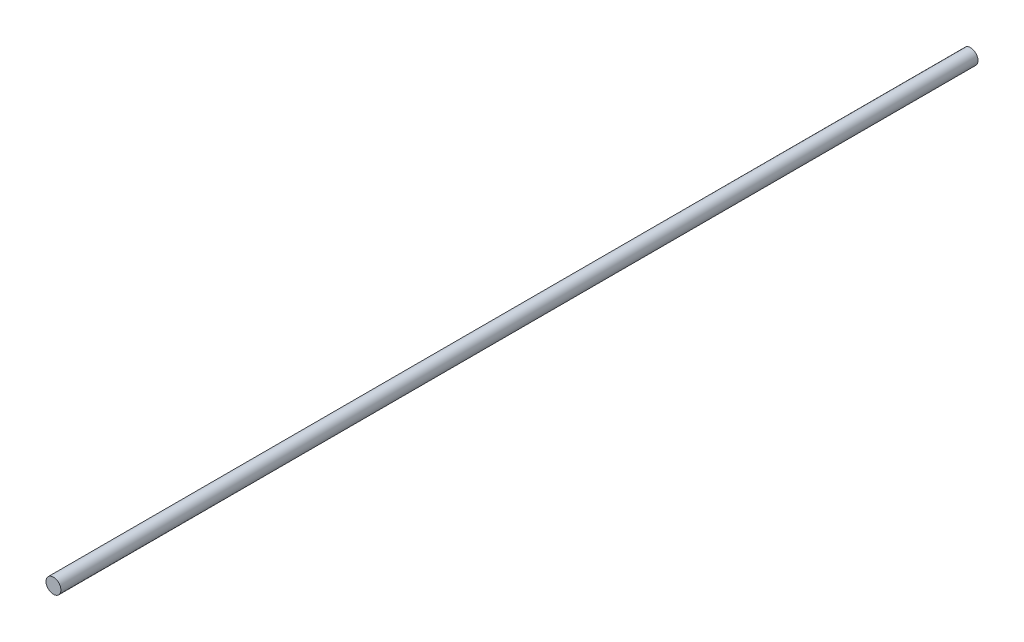
ISO-10303-21;
HEADER;
FILE_DESCRIPTION(('STEP AP214'),'2;1');
FILE_NAME('part.step','',(''),(''),'','','');
FILE_SCHEMA(('AUTOMOTIVE_DESIGN { 1 0 10303 214 1 1 1 1 }'));
ENDSEC;
DATA;
#1=APPLICATION_CONTEXT('core data for automotive mechanical design processes');
#2=APPLICATION_PROTOCOL_DEFINITION('international standard','automotive_design',2000,#1);
#3=PRODUCT_CONTEXT('',#1,'mechanical');
#4=PRODUCT('Part','Part','',(#3));
#5=PRODUCT_RELATED_PRODUCT_CATEGORY('part','',(#4));
#6=PRODUCT_DEFINITION_FORMATION('','',#4);
#7=PRODUCT_DEFINITION_CONTEXT('part definition',#1,'design');
#8=PRODUCT_DEFINITION('design','',#6,#7);
#9=PRODUCT_DEFINITION_SHAPE('','',#8);
#10=(LENGTH_UNIT() NAMED_UNIT(*) SI_UNIT(.MILLI.,.METRE.));
#11=(NAMED_UNIT(*) PLANE_ANGLE_UNIT() SI_UNIT($,.RADIAN.));
#12=(NAMED_UNIT(*) SI_UNIT($,.STERADIAN.) SOLID_ANGLE_UNIT());
#13=UNCERTAINTY_MEASURE_WITH_UNIT(LENGTH_MEASURE(1.E-05),#10,'distance_accuracy_value','');
#14=(GEOMETRIC_REPRESENTATION_CONTEXT(3) GLOBAL_UNCERTAINTY_ASSIGNED_CONTEXT((#13)) GLOBAL_UNIT_ASSIGNED_CONTEXT((#10,
#11,#12)) REPRESENTATION_CONTEXT('',''));
#15=CARTESIAN_POINT('',(0.,0.,0.));
#16=DIRECTION('',(0.,0.,1.));
#17=DIRECTION('',(1.,0.,0.));
#18=AXIS2_PLACEMENT_3D('',#15,#16,#17);
#19=CARTESIAN_POINT('',(0.,0.,307.5));
#20=DIRECTION('',(0.,0.,-1.));
#21=DIRECTION('',(-1.,0.,0.));
#22=AXIS2_PLACEMENT_3D('',#19,#20,#21);
#23=CYLINDRICAL_SURFACE('',#22,5.);
#24=CARTESIAN_POINT('',(0.,0.,307.5));
#25=DIRECTION('',(0.,0.,1.));
#26=DIRECTION('',(1.,0.,0.));
#27=AXIS2_PLACEMENT_3D('',#24,#25,#26);
#28=CIRCLE('',#27,5.);
#29=CARTESIAN_POINT('',(5.,0.,307.5));
#30=VERTEX_POINT('',#29);
#31=EDGE_CURVE('E10',#30,#30,#28,.T.);
#32=ORIENTED_EDGE('',*,*,#31,.F.);
#33=EDGE_LOOP('',(#32));
#34=FACE_BOUND('',#33,.T.);
#35=CARTESIAN_POINT('',(0.,0.,-307.5));
#36=DIRECTION('',(0.,0.,1.));
#37=DIRECTION('',(1.,0.,0.));
#38=AXIS2_PLACEMENT_3D('',#35,#36,#37);
#39=CIRCLE('',#38,5.);
#40=CARTESIAN_POINT('',(5.,0.,-307.5));
#41=VERTEX_POINT('',#40);
#42=EDGE_CURVE('E34',#41,#41,#39,.T.);
#43=ORIENTED_EDGE('',*,*,#42,.T.);
#44=EDGE_LOOP('',(#43));
#45=FACE_BOUND('',#44,.T.);
#46=ADVANCED_FACE('F31',(#34,#45),#23,.T.);
#47=CARTESIAN_POINT('',(0.,0.,307.5));
#48=DIRECTION('',(0.,0.,1.));
#49=DIRECTION('',(1.,0.,0.));
#50=AXIS2_PLACEMENT_3D('',#47,#48,#49);
#51=PLANE('',#50);
#52=ORIENTED_EDGE('',*,*,#31,.T.);
#53=EDGE_LOOP('',(#52));
#54=FACE_BOUND('',#53,.T.);
#55=ADVANCED_FACE('F46',(#54),#51,.T.);
#56=CARTESIAN_POINT('',(0.,0.,-307.5));
#57=DIRECTION('',(0.,0.,1.));
#58=DIRECTION('',(1.,0.,0.));
#59=AXIS2_PLACEMENT_3D('',#56,#57,#58);
#60=PLANE('',#59);
#61=ORIENTED_EDGE('',*,*,#42,.F.);
#62=EDGE_LOOP('',(#61));
#63=FACE_BOUND('',#62,.T.);
#64=ADVANCED_FACE('F44',(#63),#60,.F.);
#65=CLOSED_SHELL('',(#46,#55,#64));
#66=MANIFOLD_SOLID_BREP('B2',#65);
#67=ADVANCED_BREP_SHAPE_REPRESENTATION('',(#18,#66),#14);
#68=SHAPE_DEFINITION_REPRESENTATION(#9,#67);
ENDSEC;
END-ISO-10303-21;
